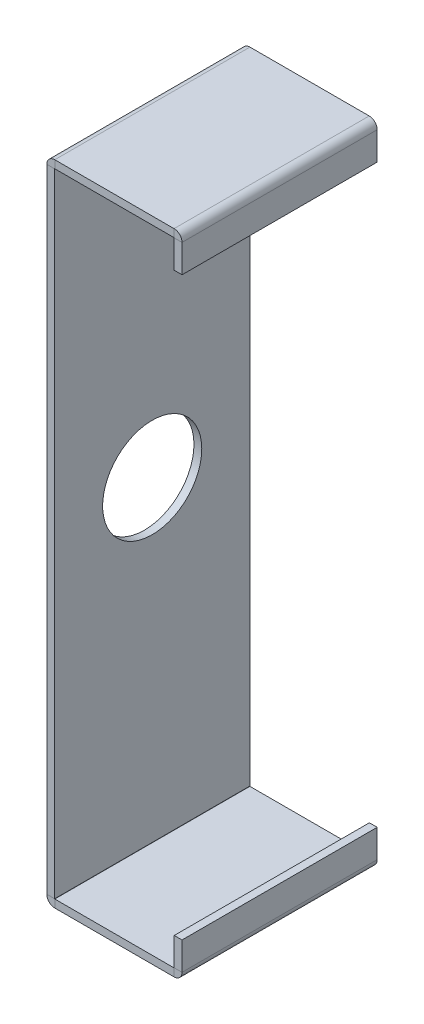
ISO-10303-21;
HEADER;
FILE_DESCRIPTION(('STEP AP214'),'2;1');
FILE_NAME('part.step','',(''),(''),'','','');
FILE_SCHEMA(('AUTOMOTIVE_DESIGN { 1 0 10303 214 1 1 1 1 }'));
ENDSEC;
DATA;
#1=APPLICATION_CONTEXT('core data for automotive mechanical design processes');
#2=APPLICATION_PROTOCOL_DEFINITION('international standard','automotive_design',2000,#1);
#3=PRODUCT_CONTEXT('',#1,'mechanical');
#4=PRODUCT('Part','Part','',(#3));
#5=PRODUCT_RELATED_PRODUCT_CATEGORY('part','',(#4));
#6=PRODUCT_DEFINITION_FORMATION('','',#4);
#7=PRODUCT_DEFINITION_CONTEXT('part definition',#1,'design');
#8=PRODUCT_DEFINITION('design','',#6,#7);
#9=PRODUCT_DEFINITION_SHAPE('','',#8);
#10=(LENGTH_UNIT() NAMED_UNIT(*) SI_UNIT(.MILLI.,.METRE.));
#11=(NAMED_UNIT(*) PLANE_ANGLE_UNIT() SI_UNIT($,.RADIAN.));
#12=(NAMED_UNIT(*) SI_UNIT($,.STERADIAN.) SOLID_ANGLE_UNIT());
#13=UNCERTAINTY_MEASURE_WITH_UNIT(LENGTH_MEASURE(1.E-05),#10,'distance_accuracy_value','');
#14=(GEOMETRIC_REPRESENTATION_CONTEXT(3) GLOBAL_UNCERTAINTY_ASSIGNED_CONTEXT((#13)) GLOBAL_UNIT_ASSIGNED_CONTEXT((#10,
#11,#12)) REPRESENTATION_CONTEXT('',''));
#15=CARTESIAN_POINT('',(0.,0.,0.));
#16=DIRECTION('',(0.,0.,1.));
#17=DIRECTION('',(1.,0.,0.));
#18=AXIS2_PLACEMENT_3D('',#15,#16,#17);
#19=CARTESIAN_POINT('',(5.24362769471076,-2.60202769471077,-1.5875));
#20=DIRECTION('',(-1.,0.,0.));
#21=DIRECTION('',(0.,0.,-1.));
#22=AXIS2_PLACEMENT_3D('',#19,#20,#21);
#23=PLANE('',#22);
#24=CARTESIAN_POINT('',(5.24362769471079,5.14497230528923,0.));
#25=DIRECTION('',(1.,0.,0.));
#26=DIRECTION('',(0.,0.,-1.));
#27=AXIS2_PLACEMENT_3D('',#24,#25,#26);
#28=CIRCLE('',#27,0.80644999999999);
#29=CARTESIAN_POINT('',(5.24362769471079,5.14497230528923,-0.80644999999999));
#30=VERTEX_POINT('',#29);
#31=EDGE_CURVE('E741',#30,#30,#28,.T.);
#32=ORIENTED_EDGE('',*,*,#31,.F.);
#33=EDGE_LOOP('',(#32));
#34=FACE_BOUND('',#33,.T.);
#35=DIRECTION('',(0.,1.,0.));
#36=VECTOR('',#35,1.);
#37=CARTESIAN_POINT('',(5.24362769471081,12.8919723052892,-1.5875));
#38=LINE('',#37,#36);
#39=CARTESIAN_POINT('',(5.24362769471077,0.0025400000000001,-1.5875));
#40=VERTEX_POINT('',#39);
#41=CARTESIAN_POINT('',(5.2436276947108,10.2874046105785,-1.5875));
#42=VERTEX_POINT('',#41);
#43=EDGE_CURVE('E67',#40,#42,#38,.T.);
#44=ORIENTED_EDGE('',*,*,#43,.T.);
#45=DIRECTION('',(0.,0.,1.));
#46=VECTOR('',#45,1.);
#47=CARTESIAN_POINT('',(5.2436276947108,10.2874046105785,-1.5875));
#48=LINE('',#47,#46);
#49=CARTESIAN_POINT('',(5.2436276947108,10.2874046105785,1.5875));
#50=VERTEX_POINT('',#49);
#51=EDGE_CURVE('E59',#42,#50,#48,.T.);
#52=ORIENTED_EDGE('',*,*,#51,.T.);
#53=DIRECTION('',(0.,-1.,0.));
#54=VECTOR('',#53,1.);
#55=CARTESIAN_POINT('',(5.24362769471081,12.8919723052892,1.5875));
#56=LINE('',#55,#54);
#57=CARTESIAN_POINT('',(5.24362769471077,0.0025400000000001,1.5875));
#58=VERTEX_POINT('',#57);
#59=EDGE_CURVE('E75',#50,#58,#56,.T.);
#60=ORIENTED_EDGE('',*,*,#59,.T.);
#61=DIRECTION('',(0.,0.,1.));
#62=VECTOR('',#61,1.);
#63=CARTESIAN_POINT('',(5.24362769471077,0.00253999999999879,-1.5875));
#64=LINE('',#63,#62);
#65=EDGE_CURVE('E366',#40,#58,#64,.T.);
#66=ORIENTED_EDGE('',*,*,#65,.F.);
#67=EDGE_LOOP('',(#44,#52,#60,#66));
#68=FACE_BOUND('',#67,.T.);
#69=ADVANCED_FACE('F50',(#34,#68),#23,.F.);
#70=CARTESIAN_POINT('',(5.11662769471081,12.8919723052892,1.5875));
#71=DIRECTION('',(0.,0.,1.));
#72=DIRECTION('',(0.,-1.,0.));
#73=AXIS2_PLACEMENT_3D('',#70,#71,#72);
#74=PLANE('',#73);
#75=DIRECTION('',(1.,0.,0.));
#76=VECTOR('',#75,1.);
#77=CARTESIAN_POINT('',(5.1166276947108,10.2874046105785,1.5875));
#78=LINE('',#77,#76);
#79=CARTESIAN_POINT('',(5.1166276947108,10.2874046105785,1.5875));
#80=VERTEX_POINT('',#79);
#81=EDGE_CURVE('E373',#80,#50,#78,.T.);
#82=ORIENTED_EDGE('',*,*,#81,.F.);
#83=DIRECTION('',(0.,-1.,0.));
#84=VECTOR('',#83,1.);
#85=CARTESIAN_POINT('',(5.11662769471081,12.8919723052892,1.5875));
#86=LINE('',#85,#84);
#87=CARTESIAN_POINT('',(5.11662769471077,0.00254000000000053,1.5875));
#88=VERTEX_POINT('',#87);
#89=EDGE_CURVE('E54',#80,#88,#86,.T.);
#90=ORIENTED_EDGE('',*,*,#89,.T.);
#91=DIRECTION('',(1.,0.,0.));
#92=VECTOR('',#91,1.);
#93=CARTESIAN_POINT('',(5.11662769471077,0.00254000000000053,1.5875));
#94=LINE('',#93,#92);
#95=EDGE_CURVE('E368',#88,#58,#94,.T.);
#96=ORIENTED_EDGE('',*,*,#95,.T.);
#97=ORIENTED_EDGE('',*,*,#59,.F.);
#98=EDGE_LOOP('',(#82,#90,#96,#97));
#99=FACE_BOUND('',#98,.T.);
#100=ADVANCED_FACE('F382',(#99),#74,.T.);
#101=CARTESIAN_POINT('',(5.11662769471081,12.8919723052892,-1.5875));
#102=DIRECTION('',(0.,0.,-1.));
#103=DIRECTION('',(0.,1.,0.));
#104=AXIS2_PLACEMENT_3D('',#101,#102,#103);
#105=PLANE('',#104);
#106=DIRECTION('',(-1.,0.,0.));
#107=VECTOR('',#106,1.);
#108=CARTESIAN_POINT('',(5.1166276947108,10.2874046105785,-1.5875));
#109=LINE('',#108,#107);
#110=CARTESIAN_POINT('',(5.1166276947108,10.2874046105785,-1.5875));
#111=VERTEX_POINT('',#110);
#112=EDGE_CURVE('E12',#42,#111,#109,.T.);
#113=ORIENTED_EDGE('',*,*,#112,.F.);
#114=ORIENTED_EDGE('',*,*,#43,.F.);
#115=DIRECTION('',(-1.,0.,0.));
#116=VECTOR('',#115,1.);
#117=CARTESIAN_POINT('',(5.11662769471077,0.00254000000000053,-1.5875));
#118=LINE('',#117,#116);
#119=CARTESIAN_POINT('',(5.11662769471077,0.00254000000000462,-1.5875));
#120=VERTEX_POINT('',#119);
#121=EDGE_CURVE('E363',#40,#120,#118,.T.);
#122=ORIENTED_EDGE('',*,*,#121,.T.);
#123=DIRECTION('',(0.,1.,0.));
#124=VECTOR('',#123,1.);
#125=CARTESIAN_POINT('',(5.11662769471081,12.8919723052892,-1.5875));
#126=LINE('',#125,#124);
#127=EDGE_CURVE('E377',#120,#111,#126,.T.);
#128=ORIENTED_EDGE('',*,*,#127,.T.);
#129=EDGE_LOOP('',(#113,#114,#122,#128));
#130=FACE_BOUND('',#129,.T.);
#131=ADVANCED_FACE('F52',(#130),#105,.T.);
#132=CARTESIAN_POINT('',(5.11662769471076,-2.60202769471077,-1.5875));
#133=DIRECTION('',(-1.,0.,0.));
#134=DIRECTION('',(0.,0.,-1.));
#135=AXIS2_PLACEMENT_3D('',#132,#133,#134);
#136=PLANE('',#135);
#137=CARTESIAN_POINT('',(5.11662769471079,5.14497230528923,0.));
#138=DIRECTION('',(-1.,0.,0.));
#139=DIRECTION('',(0.,-1.,0.));
#140=AXIS2_PLACEMENT_3D('',#137,#138,#139);
#141=CIRCLE('',#140,0.806449999999989);
#142=CARTESIAN_POINT('',(5.11662769471078,4.33852230528924,0.));
#143=VERTEX_POINT('',#142);
#144=EDGE_CURVE('E259',#143,#143,#141,.T.);
#145=ORIENTED_EDGE('',*,*,#144,.F.);
#146=EDGE_LOOP('',(#145));
#147=FACE_BOUND('',#146,.T.);
#148=DIRECTION('',(0.,0.,1.));
#149=VECTOR('',#148,1.);
#150=CARTESIAN_POINT('',(5.1166276947108,10.2874046105785,-1.5875));
#151=LINE('',#150,#149);
#152=EDGE_CURVE('E370',#111,#80,#151,.T.);
#153=ORIENTED_EDGE('',*,*,#152,.F.);
#154=ORIENTED_EDGE('',*,*,#127,.F.);
#155=DIRECTION('',(0.,0.,1.));
#156=VECTOR('',#155,1.);
#157=CARTESIAN_POINT('',(5.11662769471077,0.00253999999999966,-1.5875));
#158=LINE('',#157,#156);
#159=EDGE_CURVE('E360',#120,#88,#158,.T.);
#160=ORIENTED_EDGE('',*,*,#159,.T.);
#161=ORIENTED_EDGE('',*,*,#89,.F.);
#162=EDGE_LOOP('',(#153,#154,#160,#161));
#163=FACE_BOUND('',#162,.T.);
#164=ADVANCED_FACE('F464',(#147,#163),#136,.T.);
#165=CARTESIAN_POINT('',(7.31667230528923,0.458672305289232,1.5875));
#166=DIRECTION('',(0.,1.,0.));
#167=DIRECTION('',(0.,0.,-1.));
#168=AXIS2_PLACEMENT_3D('',#165,#166,#167);
#169=PLANE('',#168);
#170=DIRECTION('',(0.,0.,-1.));
#171=VECTOR('',#170,1.);
#172=CARTESIAN_POINT('',(7.18967230528923,0.458672305289231,1.5875));
#173=LINE('',#172,#171);
#174=CARTESIAN_POINT('',(7.18967230528923,0.458672305289231,1.5875));
#175=VERTEX_POINT('',#174);
#176=CARTESIAN_POINT('',(7.18967230528923,0.458672305289231,-1.5875));
#177=VERTEX_POINT('',#176);
#178=EDGE_CURVE('E332',#175,#177,#173,.T.);
#179=ORIENTED_EDGE('',*,*,#178,.F.);
#180=DIRECTION('',(-1.,0.,0.));
#181=VECTOR('',#180,1.);
#182=CARTESIAN_POINT('',(7.31667230528923,0.458672305289232,1.5875));
#183=LINE('',#182,#181);
#184=CARTESIAN_POINT('',(7.31667230528923,0.458672305289232,1.5875));
#185=VERTEX_POINT('',#184);
#186=EDGE_CURVE('E342',#185,#175,#183,.T.);
#187=ORIENTED_EDGE('',*,*,#186,.F.);
#188=DIRECTION('',(0.,0.,-1.));
#189=VECTOR('',#188,1.);
#190=CARTESIAN_POINT('',(7.31667230528923,0.458672305289232,1.5875));
#191=LINE('',#190,#189);
#192=CARTESIAN_POINT('',(7.31667230528923,0.458672305289232,-1.5875));
#193=VERTEX_POINT('',#192);
#194=EDGE_CURVE('E349',#185,#193,#191,.T.);
#195=ORIENTED_EDGE('',*,*,#194,.T.);
#196=DIRECTION('',(-1.,0.,0.));
#197=VECTOR('',#196,1.);
#198=CARTESIAN_POINT('',(7.31667230528923,0.458672305289232,-1.5875));
#199=LINE('',#198,#197);
#200=EDGE_CURVE('E347',#193,#177,#199,.T.);
#201=ORIENTED_EDGE('',*,*,#200,.T.);
#202=EDGE_LOOP('',(#179,#187,#195,#201));
#203=FACE_BOUND('',#202,.T.);
#204=ADVANCED_FACE('F467',(#203),#169,.T.);
#205=CARTESIAN_POINT('',(7.31667230528929,-15.0353276947108,1.5875));
#206=DIRECTION('',(0.,0.,1.));
#207=DIRECTION('',(0.,1.,0.));
#208=AXIS2_PLACEMENT_3D('',#205,#206,#207);
#209=PLANE('',#208);
#210=DIRECTION('',(-1.,0.,0.));
#211=VECTOR('',#210,1.);
#212=CARTESIAN_POINT('',(7.31667230528923,0.00254000000000053,1.5875));
#213=LINE('',#212,#211);
#214=CARTESIAN_POINT('',(7.31667230528923,0.00254000000000462,1.5875));
#215=VERTEX_POINT('',#214);
#216=CARTESIAN_POINT('',(7.18967230528923,0.00253999999999966,1.5875));
#217=VERTEX_POINT('',#216);
#218=EDGE_CURVE('E324',#215,#217,#213,.T.);
#219=ORIENTED_EDGE('',*,*,#218,.F.);
#220=DIRECTION('',(0.,1.,0.));
#221=VECTOR('',#220,1.);
#222=CARTESIAN_POINT('',(7.31667230528929,-15.0353276947108,1.5875));
#223=LINE('',#222,#221);
#224=EDGE_CURVE('E345',#215,#185,#223,.T.);
#225=ORIENTED_EDGE('',*,*,#224,.T.);
#226=ORIENTED_EDGE('',*,*,#186,.T.);
#227=DIRECTION('',(0.,1.,0.));
#228=VECTOR('',#227,1.);
#229=CARTESIAN_POINT('',(7.18967230528929,-15.0353276947108,1.5875));
#230=LINE('',#229,#228);
#231=EDGE_CURVE('E335',#217,#175,#230,.T.);
#232=ORIENTED_EDGE('',*,*,#231,.F.);
#233=EDGE_LOOP('',(#219,#225,#226,#232));
#234=FACE_BOUND('',#233,.T.);
#235=ADVANCED_FACE('F513',(#234),#209,.T.);
#236=CARTESIAN_POINT('',(7.18967230528923,0.458672305289231,-1.5875));
#237=DIRECTION('',(1.,0.,0.));
#238=DIRECTION('',(0.,0.,-1.));
#239=AXIS2_PLACEMENT_3D('',#236,#237,#238);
#240=PLANE('',#239);
#241=DIRECTION('',(0.,-1.,0.));
#242=VECTOR('',#241,1.);
#243=CARTESIAN_POINT('',(7.18967230528929,-15.0353276947108,-1.5875));
#244=LINE('',#243,#242);
#245=CARTESIAN_POINT('',(7.18967230528923,0.00253999999999966,-1.5875));
#246=VERTEX_POINT('',#245);
#247=EDGE_CURVE('E340',#177,#246,#244,.T.);
#248=ORIENTED_EDGE('',*,*,#247,.T.);
#249=DIRECTION('',(0.,0.,1.));
#250=VECTOR('',#249,1.);
#251=CARTESIAN_POINT('',(7.18967230528923,0.00253999999999879,-1.5875));
#252=LINE('',#251,#250);
#253=EDGE_CURVE('E337',#246,#217,#252,.T.);
#254=ORIENTED_EDGE('',*,*,#253,.T.);
#255=ORIENTED_EDGE('',*,*,#231,.T.);
#256=ORIENTED_EDGE('',*,*,#178,.T.);
#257=EDGE_LOOP('',(#248,#254,#255,#256));
#258=FACE_BOUND('',#257,.T.);
#259=ADVANCED_FACE('F509',(#258),#240,.F.);
#260=CARTESIAN_POINT('',(7.31667230528929,-15.0353276947108,-1.5875));
#261=DIRECTION('',(0.,0.,-1.));
#262=DIRECTION('',(0.,-1.,0.));
#263=AXIS2_PLACEMENT_3D('',#260,#261,#262);
#264=PLANE('',#263);
#265=DIRECTION('',(1.,0.,0.));
#266=VECTOR('',#265,1.);
#267=CARTESIAN_POINT('',(7.31667230528923,0.00254000000000053,-1.5875));
#268=LINE('',#267,#266);
#269=CARTESIAN_POINT('',(7.31667230528923,0.00254000000000053,-1.5875));
#270=VERTEX_POINT('',#269);
#271=EDGE_CURVE('E315',#246,#270,#268,.T.);
#272=ORIENTED_EDGE('',*,*,#271,.F.);
#273=ORIENTED_EDGE('',*,*,#247,.F.);
#274=ORIENTED_EDGE('',*,*,#200,.F.);
#275=DIRECTION('',(0.,-1.,0.));
#276=VECTOR('',#275,1.);
#277=CARTESIAN_POINT('',(7.31667230528929,-15.0353276947108,-1.5875));
#278=LINE('',#277,#276);
#279=EDGE_CURVE('E329',#193,#270,#278,.T.);
#280=ORIENTED_EDGE('',*,*,#279,.T.);
#281=EDGE_LOOP('',(#272,#273,#274,#280));
#282=FACE_BOUND('',#281,.T.);
#283=ADVANCED_FACE('F505',(#282),#264,.T.);
#284=CARTESIAN_POINT('',(7.31667230528923,0.458672305289232,-1.5875));
#285=DIRECTION('',(1.,0.,0.));
#286=DIRECTION('',(0.,0.,-1.));
#287=AXIS2_PLACEMENT_3D('',#284,#285,#286);
#288=PLANE('',#287);
#289=DIRECTION('',(0.,0.,1.));
#290=VECTOR('',#289,1.);
#291=CARTESIAN_POINT('',(7.31667230528923,0.00253999999999966,-1.5875));
#292=LINE('',#291,#290);
#293=EDGE_CURVE('E312',#270,#215,#292,.T.);
#294=ORIENTED_EDGE('',*,*,#293,.F.);
#295=ORIENTED_EDGE('',*,*,#279,.F.);
#296=ORIENTED_EDGE('',*,*,#194,.F.);
#297=ORIENTED_EDGE('',*,*,#224,.F.);
#298=EDGE_LOOP('',(#294,#295,#296,#297));
#299=FACE_BOUND('',#298,.T.);
#300=ADVANCED_FACE('F501',(#299),#288,.T.);
#301=CARTESIAN_POINT('',(7.18713230528923,0.00254000000000001,1.5875));
#302=DIRECTION('',(0.,0.,1.));
#303=DIRECTION('',(1.,0.,0.));
#304=AXIS2_PLACEMENT_3D('',#301,#302,#303);
#305=PLANE('',#304);
#306=CARTESIAN_POINT('',(7.18713230528923,0.00254000000000001,1.5875));
#307=DIRECTION('',(0.,0.,1.));
#308=DIRECTION('',(1.,0.,0.));
#309=AXIS2_PLACEMENT_3D('',#306,#307,#308);
#310=CIRCLE('',#309,0.00254000000000001);
#311=CARTESIAN_POINT('',(7.18713230528923,0.,1.5875));
#312=VERTEX_POINT('',#311);
#313=EDGE_CURVE('E327',#217,#312,#310,.F.);
#314=ORIENTED_EDGE('',*,*,#313,.T.);
#315=DIRECTION('',(0.,1.,0.));
#316=VECTOR('',#315,1.);
#317=CARTESIAN_POINT('',(7.18713230528923,-0.127,1.5875));
#318=LINE('',#317,#316);
#319=CARTESIAN_POINT('',(7.18713230528923,-0.127,1.5875));
#320=VERTEX_POINT('',#319);
#321=EDGE_CURVE('E284',#320,#312,#318,.T.);
#322=ORIENTED_EDGE('',*,*,#321,.F.);
#323=CARTESIAN_POINT('',(7.18713230528923,0.00254000000000001,1.5875));
#324=DIRECTION('',(0.,0.,-1.));
#325=DIRECTION('',(1.,0.,0.));
#326=AXIS2_PLACEMENT_3D('',#323,#324,#325);
#327=CIRCLE('',#326,0.12954);
#328=EDGE_CURVE('E309',#215,#320,#327,.T.);
#329=ORIENTED_EDGE('',*,*,#328,.F.);
#330=ORIENTED_EDGE('',*,*,#218,.T.);
#331=EDGE_LOOP('',(#314,#322,#329,#330));
#332=FACE_BOUND('',#331,.T.);
#333=ADVANCED_FACE('F497',(#332),#305,.T.);
#334=CARTESIAN_POINT('',(7.18713230528923,0.00254000000000001,-3.1792318303355));
#335=DIRECTION('',(0.,0.,1.));
#336=DIRECTION('',(1.,0.,0.));
#337=AXIS2_PLACEMENT_3D('',#334,#335,#336);
#338=CYLINDRICAL_SURFACE('',#337,0.00254000000000001);
#339=ORIENTED_EDGE('',*,*,#253,.F.);
#340=CARTESIAN_POINT('',(7.18713230528923,0.00254000000000001,-1.5875));
#341=DIRECTION('',(0.,0.,1.));
#342=DIRECTION('',(1.,0.,0.));
#343=AXIS2_PLACEMENT_3D('',#340,#341,#342);
#344=CIRCLE('',#343,0.00254000000000001);
#345=CARTESIAN_POINT('',(7.18713230528923,0.,-1.5875));
#346=VERTEX_POINT('',#345);
#347=EDGE_CURVE('E318',#346,#246,#344,.T.);
#348=ORIENTED_EDGE('',*,*,#347,.F.);
#349=DIRECTION('',(0.,0.,1.));
#350=VECTOR('',#349,1.);
#351=CARTESIAN_POINT('',(7.18713230528923,0.,-1.5875));
#352=LINE('',#351,#350);
#353=EDGE_CURVE('E321',#346,#312,#352,.T.);
#354=ORIENTED_EDGE('',*,*,#353,.T.);
#355=ORIENTED_EDGE('',*,*,#313,.F.);
#356=EDGE_LOOP('',(#339,#348,#354,#355));
#357=FACE_BOUND('',#356,.T.);
#358=ADVANCED_FACE('F493',(#357),#338,.F.);
#359=CARTESIAN_POINT('',(7.18713230528923,0.00254000000000001,-1.5875));
#360=DIRECTION('',(0.,0.,-1.));
#361=DIRECTION('',(-1.,0.,0.));
#362=AXIS2_PLACEMENT_3D('',#359,#360,#361);
#363=PLANE('',#362);
#364=DIRECTION('',(0.,-1.,0.));
#365=VECTOR('',#364,1.);
#366=CARTESIAN_POINT('',(7.18713230528923,-0.127,-1.5875));
#367=LINE('',#366,#365);
#368=CARTESIAN_POINT('',(7.18713230528923,-0.127,-1.5875));
#369=VERTEX_POINT('',#368);
#370=EDGE_CURVE('E300',#346,#369,#367,.T.);
#371=ORIENTED_EDGE('',*,*,#370,.F.);
#372=ORIENTED_EDGE('',*,*,#347,.T.);
#373=ORIENTED_EDGE('',*,*,#271,.T.);
#374=CARTESIAN_POINT('',(7.18713230528923,0.00254000000000001,-1.5875));
#375=DIRECTION('',(0.,0.,1.));
#376=DIRECTION('',(-1.,0.,0.));
#377=AXIS2_PLACEMENT_3D('',#374,#375,#376);
#378=CIRCLE('',#377,0.12954);
#379=EDGE_CURVE('E306',#369,#270,#378,.T.);
#380=ORIENTED_EDGE('',*,*,#379,.F.);
#381=EDGE_LOOP('',(#371,#372,#373,#380));
#382=FACE_BOUND('',#381,.T.);
#383=ADVANCED_FACE('F489',(#382),#363,.T.);
#384=CARTESIAN_POINT('',(7.18713230528923,0.00254000000000001,-3.1792318303355));
#385=DIRECTION('',(0.,0.,1.));
#386=DIRECTION('',(1.,0.,0.));
#387=AXIS2_PLACEMENT_3D('',#384,#385,#386);
#388=CYLINDRICAL_SURFACE('',#387,0.12954);
#389=ORIENTED_EDGE('',*,*,#293,.T.);
#390=ORIENTED_EDGE('',*,*,#328,.T.);
#391=DIRECTION('',(0.,0.,1.));
#392=VECTOR('',#391,1.);
#393=CARTESIAN_POINT('',(7.18713230528923,-0.127,-1.5875));
#394=LINE('',#393,#392);
#395=EDGE_CURVE('E303',#369,#320,#394,.T.);
#396=ORIENTED_EDGE('',*,*,#395,.F.);
#397=ORIENTED_EDGE('',*,*,#379,.T.);
#398=EDGE_LOOP('',(#389,#390,#396,#397));
#399=FACE_BOUND('',#398,.T.);
#400=ADVANCED_FACE('F485',(#399),#388,.T.);
#401=CARTESIAN_POINT('',(7.747,-0.127,-1.5875));
#402=DIRECTION('',(0.,-1.,0.));
#403=DIRECTION('',(0.,0.,-1.));
#404=AXIS2_PLACEMENT_3D('',#401,#402,#403);
#405=PLANE('',#404);
#406=DIRECTION('',(0.,0.,1.));
#407=VECTOR('',#406,1.);
#408=CARTESIAN_POINT('',(5.24616769471077,-0.127,-1.5875));
#409=LINE('',#408,#407);
#410=CARTESIAN_POINT('',(5.24616769471077,-0.127,-1.5875));
#411=VERTEX_POINT('',#410);
#412=CARTESIAN_POINT('',(5.24616769471077,-0.127,1.5875));
#413=VERTEX_POINT('',#412);
#414=EDGE_CURVE('E279',#411,#413,#409,.T.);
#415=ORIENTED_EDGE('',*,*,#414,.F.);
#416=DIRECTION('',(-1.,0.,0.));
#417=VECTOR('',#416,1.);
#418=CARTESIAN_POINT('',(-7.747,-0.127,-1.5875));
#419=LINE('',#418,#417);
#420=EDGE_CURVE('E298',#369,#411,#419,.T.);
#421=ORIENTED_EDGE('',*,*,#420,.F.);
#422=ORIENTED_EDGE('',*,*,#395,.T.);
#423=DIRECTION('',(1.,0.,0.));
#424=VECTOR('',#423,1.);
#425=CARTESIAN_POINT('',(-7.747,-0.127,1.5875));
#426=LINE('',#425,#424);
#427=EDGE_CURVE('E287',#413,#320,#426,.T.);
#428=ORIENTED_EDGE('',*,*,#427,.F.);
#429=EDGE_LOOP('',(#415,#421,#422,#428));
#430=FACE_BOUND('',#429,.T.);
#431=ADVANCED_FACE('F481',(#430),#405,.T.);
#432=CARTESIAN_POINT('',(-7.747,-0.127,-1.5875));
#433=DIRECTION('',(0.,0.,-1.));
#434=DIRECTION('',(-1.,0.,0.));
#435=AXIS2_PLACEMENT_3D('',#432,#433,#434);
#436=PLANE('',#435);
#437=DIRECTION('',(0.,-1.,0.));
#438=VECTOR('',#437,1.);
#439=CARTESIAN_POINT('',(5.24616769471077,-0.127,-1.5875));
#440=LINE('',#439,#438);
#441=CARTESIAN_POINT('',(5.24616769471077,0.,-1.5875));
#442=VERTEX_POINT('',#441);
#443=EDGE_CURVE('E352',#442,#411,#440,.T.);
#444=ORIENTED_EDGE('',*,*,#443,.F.);
#445=DIRECTION('',(-1.,0.,0.));
#446=VECTOR('',#445,1.);
#447=CARTESIAN_POINT('',(-7.747,0.,-1.5875));
#448=LINE('',#447,#446);
#449=EDGE_CURVE('E296',#346,#442,#448,.T.);
#450=ORIENTED_EDGE('',*,*,#449,.F.);
#451=ORIENTED_EDGE('',*,*,#370,.T.);
#452=ORIENTED_EDGE('',*,*,#420,.T.);
#453=EDGE_LOOP('',(#444,#450,#451,#452));
#454=FACE_BOUND('',#453,.T.);
#455=ADVANCED_FACE('F477',(#454),#436,.T.);
#456=CARTESIAN_POINT('',(7.747,0.,-1.5875));
#457=DIRECTION('',(0.,-1.,0.));
#458=DIRECTION('',(0.,0.,-1.));
#459=AXIS2_PLACEMENT_3D('',#456,#457,#458);
#460=PLANE('',#459);
#461=ORIENTED_EDGE('',*,*,#449,.T.);
#462=DIRECTION('',(0.,0.,1.));
#463=VECTOR('',#462,1.);
#464=CARTESIAN_POINT('',(5.24616769471077,0.,-1.5875));
#465=LINE('',#464,#463);
#466=CARTESIAN_POINT('',(5.24616769471077,0.,1.5875));
#467=VERTEX_POINT('',#466);
#468=EDGE_CURVE('E293',#442,#467,#465,.T.);
#469=ORIENTED_EDGE('',*,*,#468,.T.);
#470=DIRECTION('',(1.,0.,0.));
#471=VECTOR('',#470,1.);
#472=CARTESIAN_POINT('',(-7.747,0.,1.5875));
#473=LINE('',#472,#471);
#474=EDGE_CURVE('E290',#467,#312,#473,.T.);
#475=ORIENTED_EDGE('',*,*,#474,.T.);
#476=ORIENTED_EDGE('',*,*,#353,.F.);
#477=EDGE_LOOP('',(#461,#469,#475,#476));
#478=FACE_BOUND('',#477,.T.);
#479=ADVANCED_FACE('F473',(#478),#460,.F.);
#480=CARTESIAN_POINT('',(-7.747,-0.127,1.5875));
#481=DIRECTION('',(0.,0.,1.));
#482=DIRECTION('',(1.,0.,0.));
#483=AXIS2_PLACEMENT_3D('',#480,#481,#482);
#484=PLANE('',#483);
#485=DIRECTION('',(0.,1.,0.));
#486=VECTOR('',#485,1.);
#487=CARTESIAN_POINT('',(5.24616769471077,-0.127,1.5875));
#488=LINE('',#487,#486);
#489=EDGE_CURVE('E355',#413,#467,#488,.T.);
#490=ORIENTED_EDGE('',*,*,#489,.F.);
#491=ORIENTED_EDGE('',*,*,#427,.T.);
#492=ORIENTED_EDGE('',*,*,#321,.T.);
#493=ORIENTED_EDGE('',*,*,#474,.F.);
#494=EDGE_LOOP('',(#490,#491,#492,#493));
#495=FACE_BOUND('',#494,.T.);
#496=ADVANCED_FACE('F469',(#495),#484,.T.);
#497=CARTESIAN_POINT('',(5.24616769471077,0.00254000000000001,-1.5875));
#498=DIRECTION('',(0.,0.,-1.));
#499=DIRECTION('',(-1.,0.,0.));
#500=AXIS2_PLACEMENT_3D('',#497,#498,#499);
#501=PLANE('',#500);
#502=ORIENTED_EDGE('',*,*,#121,.F.);
#503=CARTESIAN_POINT('',(5.24616769471077,0.00254000000000001,-1.5875));
#504=DIRECTION('',(0.,0.,-1.));
#505=DIRECTION('',(-1.,0.,0.));
#506=AXIS2_PLACEMENT_3D('',#503,#504,#505);
#507=CIRCLE('',#506,0.00254000000000001);
#508=EDGE_CURVE('E267',#40,#442,#507,.F.);
#509=ORIENTED_EDGE('',*,*,#508,.T.);
#510=ORIENTED_EDGE('',*,*,#443,.T.);
#511=CARTESIAN_POINT('',(5.24616769471077,0.00254000000000001,-1.5875));
#512=DIRECTION('',(0.,0.,1.));
#513=DIRECTION('',(-1.,0.,0.));
#514=AXIS2_PLACEMENT_3D('',#511,#512,#513);
#515=CIRCLE('',#514,0.12954);
#516=EDGE_CURVE('E273',#120,#411,#515,.T.);
#517=ORIENTED_EDGE('',*,*,#516,.F.);
#518=EDGE_LOOP('',(#502,#509,#510,#517));
#519=FACE_BOUND('',#518,.T.);
#520=ADVANCED_FACE('F472',(#519),#501,.T.);
#521=CARTESIAN_POINT('',(5.24616769471077,0.00254000000000001,1.5875));
#522=DIRECTION('',(0.,0.,1.));
#523=DIRECTION('',(1.,0.,0.));
#524=AXIS2_PLACEMENT_3D('',#521,#522,#523);
#525=PLANE('',#524);
#526=CARTESIAN_POINT('',(5.24616769471077,0.00254000000000001,1.5875));
#527=DIRECTION('',(0.,0.,-1.));
#528=DIRECTION('',(-1.,0.,0.));
#529=AXIS2_PLACEMENT_3D('',#526,#527,#528);
#530=CIRCLE('',#529,0.00254000000000001);
#531=EDGE_CURVE('E277',#467,#58,#530,.T.);
#532=ORIENTED_EDGE('',*,*,#531,.T.);
#533=ORIENTED_EDGE('',*,*,#95,.F.);
#534=CARTESIAN_POINT('',(5.24616769471077,0.00254000000000001,1.5875));
#535=DIRECTION('',(0.,0.,-1.));
#536=DIRECTION('',(1.,0.,0.));
#537=AXIS2_PLACEMENT_3D('',#534,#535,#536);
#538=CIRCLE('',#537,0.12954);
#539=EDGE_CURVE('E276',#413,#88,#538,.T.);
#540=ORIENTED_EDGE('',*,*,#539,.F.);
#541=ORIENTED_EDGE('',*,*,#489,.T.);
#542=EDGE_LOOP('',(#532,#533,#540,#541));
#543=FACE_BOUND('',#542,.T.);
#544=ADVANCED_FACE('F385',(#543),#525,.T.);
#545=CARTESIAN_POINT('',(5.24616769471077,0.00254000000000001,3.1792318303355));
#546=DIRECTION('',(0.,0.,-1.));
#547=DIRECTION('',(-1.,0.,0.));
#548=AXIS2_PLACEMENT_3D('',#545,#546,#547);
#549=CYLINDRICAL_SURFACE('',#548,0.12954);
#550=ORIENTED_EDGE('',*,*,#414,.T.);
#551=ORIENTED_EDGE('',*,*,#539,.T.);
#552=ORIENTED_EDGE('',*,*,#159,.F.);
#553=ORIENTED_EDGE('',*,*,#516,.T.);
#554=EDGE_LOOP('',(#550,#551,#552,#553));
#555=FACE_BOUND('',#554,.T.);
#556=ADVANCED_FACE('F523',(#555),#549,.T.);
#557=CARTESIAN_POINT('',(5.24616769471077,0.00254000000000001,3.1792318303355));
#558=DIRECTION('',(0.,0.,-1.));
#559=DIRECTION('',(-1.,0.,0.));
#560=AXIS2_PLACEMENT_3D('',#557,#558,#559);
#561=CYLINDRICAL_SURFACE('',#560,0.00254000000000001);
#562=ORIENTED_EDGE('',*,*,#468,.F.);
#563=ORIENTED_EDGE('',*,*,#508,.F.);
#564=ORIENTED_EDGE('',*,*,#65,.T.);
#565=ORIENTED_EDGE('',*,*,#531,.F.);
#566=EDGE_LOOP('',(#562,#563,#564,#565));
#567=FACE_BOUND('',#566,.T.);
#568=ADVANCED_FACE('F390',(#567),#561,.F.);
#569=CARTESIAN_POINT('',(5.2461676947108,10.2874046105785,-1.5875));
#570=DIRECTION('',(0.,0.,-1.));
#571=DIRECTION('',(-1.,0.,0.));
#572=AXIS2_PLACEMENT_3D('',#569,#570,#571);
#573=PLANE('',#572);
#574=DIRECTION('',(0.,1.,0.));
#575=VECTOR('',#574,1.);
#576=CARTESIAN_POINT('',(5.24616769471081,10.4169446105785,-1.5875));
#577=LINE('',#576,#575);
#578=CARTESIAN_POINT('',(5.2461676947108,10.2899446105785,-1.5875));
#579=VERTEX_POINT('',#578);
#580=CARTESIAN_POINT('',(5.2461676947108,10.4169446105785,-1.5875));
#581=VERTEX_POINT('',#580);
#582=EDGE_CURVE('E403',#579,#581,#577,.T.);
#583=ORIENTED_EDGE('',*,*,#582,.F.);
#584=CARTESIAN_POINT('',(5.2461676947108,10.2874046105785,-1.5875));
#585=DIRECTION('',(0.,0.,-1.));
#586=DIRECTION('',(-1.,0.,0.));
#587=AXIS2_PLACEMENT_3D('',#584,#585,#586);
#588=CIRCLE('',#587,0.00254000000000001);
#589=EDGE_CURVE('E268',#579,#42,#588,.F.);
#590=ORIENTED_EDGE('',*,*,#589,.T.);
#591=ORIENTED_EDGE('',*,*,#112,.T.);
#592=CARTESIAN_POINT('',(5.2461676947108,10.2874046105785,-1.5875));
#593=DIRECTION('',(0.,0.,1.));
#594=DIRECTION('',(-1.,0.,0.));
#595=AXIS2_PLACEMENT_3D('',#592,#593,#594);
#596=CIRCLE('',#595,0.12954);
#597=EDGE_CURVE('E260',#581,#111,#596,.T.);
#598=ORIENTED_EDGE('',*,*,#597,.F.);
#599=EDGE_LOOP('',(#583,#590,#591,#598));
#600=FACE_BOUND('',#599,.T.);
#601=ADVANCED_FACE('F402',(#600),#573,.T.);
#602=CARTESIAN_POINT('',(5.2461676947108,10.2874046105785,1.5875));
#603=DIRECTION('',(0.,0.,1.));
#604=DIRECTION('',(1.,0.,0.));
#605=AXIS2_PLACEMENT_3D('',#602,#603,#604);
#606=PLANE('',#605);
#607=CARTESIAN_POINT('',(5.2461676947108,10.2874046105785,1.5875));
#608=DIRECTION('',(0.,0.,-1.));
#609=DIRECTION('',(-1.,0.,0.));
#610=AXIS2_PLACEMENT_3D('',#607,#608,#609);
#611=CIRCLE('',#610,0.00254000000000001);
#612=CARTESIAN_POINT('',(5.2461676947108,10.2899446105785,1.5875));
#613=VERTEX_POINT('',#612);
#614=EDGE_CURVE('E264',#50,#613,#611,.T.);
#615=ORIENTED_EDGE('',*,*,#614,.T.);
#616=DIRECTION('',(0.,-1.,0.));
#617=VECTOR('',#616,1.);
#618=CARTESIAN_POINT('',(5.24616769471081,10.4169446105785,1.5875));
#619=LINE('',#618,#617);
#620=CARTESIAN_POINT('',(5.24616769471081,10.4169446105785,1.5875));
#621=VERTEX_POINT('',#620);
#622=EDGE_CURVE('E202',#621,#613,#619,.T.);
#623=ORIENTED_EDGE('',*,*,#622,.F.);
#624=CARTESIAN_POINT('',(5.2461676947108,10.2874046105785,1.5875));
#625=DIRECTION('',(0.,0.,-1.));
#626=DIRECTION('',(1.,0.,0.));
#627=AXIS2_PLACEMENT_3D('',#624,#625,#626);
#628=CIRCLE('',#627,0.12954);
#629=EDGE_CURVE('E263',#80,#621,#628,.T.);
#630=ORIENTED_EDGE('',*,*,#629,.F.);
#631=ORIENTED_EDGE('',*,*,#81,.T.);
#632=EDGE_LOOP('',(#615,#623,#630,#631));
#633=FACE_BOUND('',#632,.T.);
#634=ADVANCED_FACE('F446',(#633),#606,.T.);
#635=CARTESIAN_POINT('',(5.2461676947108,10.2874046105785,3.1792318303355));
#636=DIRECTION('',(0.,0.,-1.));
#637=DIRECTION('',(-1.,0.,0.));
#638=AXIS2_PLACEMENT_3D('',#635,#636,#637);
#639=CYLINDRICAL_SURFACE('',#638,0.12954);
#640=ORIENTED_EDGE('',*,*,#152,.T.);
#641=ORIENTED_EDGE('',*,*,#629,.T.);
#642=DIRECTION('',(0.,0.,1.));
#643=VECTOR('',#642,1.);
#644=CARTESIAN_POINT('',(5.24616769471081,10.4169446105785,-1.5875));
#645=LINE('',#644,#643);
#646=EDGE_CURVE('E414',#581,#621,#645,.T.);
#647=ORIENTED_EDGE('',*,*,#646,.F.);
#648=ORIENTED_EDGE('',*,*,#597,.T.);
#649=EDGE_LOOP('',(#640,#641,#647,#648));
#650=FACE_BOUND('',#649,.T.);
#651=ADVANCED_FACE('F443',(#650),#639,.T.);
#652=CARTESIAN_POINT('',(5.2461676947108,10.2874046105785,3.1792318303355));
#653=DIRECTION('',(0.,0.,-1.));
#654=DIRECTION('',(-1.,0.,0.));
#655=AXIS2_PLACEMENT_3D('',#652,#653,#654);
#656=CYLINDRICAL_SURFACE('',#655,0.00254000000000001);
#657=ORIENTED_EDGE('',*,*,#51,.F.);
#658=ORIENTED_EDGE('',*,*,#589,.F.);
#659=DIRECTION('',(0.,0.,1.));
#660=VECTOR('',#659,1.);
#661=CARTESIAN_POINT('',(5.2461676947108,10.2899446105785,-1.5875));
#662=LINE('',#661,#660);
#663=EDGE_CURVE('E199',#579,#613,#662,.T.);
#664=ORIENTED_EDGE('',*,*,#663,.T.);
#665=ORIENTED_EDGE('',*,*,#614,.F.);
#666=EDGE_LOOP('',(#657,#658,#664,#665));
#667=FACE_BOUND('',#666,.T.);
#668=ADVANCED_FACE('F401',(#667),#656,.F.);
#669=CARTESIAN_POINT('',(7.31667230528926,9.83127230528921,1.5875));
#670=DIRECTION('',(0.,-1.,0.));
#671=DIRECTION('',(0.,0.,1.));
#672=AXIS2_PLACEMENT_3D('',#669,#670,#671);
#673=PLANE('',#672);
#674=DIRECTION('',(0.,0.,1.));
#675=VECTOR('',#674,1.);
#676=CARTESIAN_POINT('',(7.18967230528926,9.83127230528922,1.5875));
#677=LINE('',#676,#675);
#678=CARTESIAN_POINT('',(7.18967230528926,9.83127230528922,-1.5875));
#679=VERTEX_POINT('',#678);
#680=CARTESIAN_POINT('',(7.18967230528926,9.83127230528922,1.5875));
#681=VERTEX_POINT('',#680);
#682=EDGE_CURVE('E242',#679,#681,#677,.T.);
#683=ORIENTED_EDGE('',*,*,#682,.F.);
#684=DIRECTION('',(-1.,0.,0.));
#685=VECTOR('',#684,1.);
#686=CARTESIAN_POINT('',(7.31667230528926,9.83127230528921,-1.5875));
#687=LINE('',#686,#685);
#688=CARTESIAN_POINT('',(7.31667230528926,9.83127230528921,-1.5875));
#689=VERTEX_POINT('',#688);
#690=EDGE_CURVE('E247',#689,#679,#687,.T.);
#691=ORIENTED_EDGE('',*,*,#690,.F.);
#692=DIRECTION('',(0.,0.,1.));
#693=VECTOR('',#692,1.);
#694=CARTESIAN_POINT('',(7.31667230528926,9.83127230528921,1.5875));
#695=LINE('',#694,#693);
#696=CARTESIAN_POINT('',(7.31667230528926,9.83127230528921,1.5875));
#697=VERTEX_POINT('',#696);
#698=EDGE_CURVE('E255',#689,#697,#695,.T.);
#699=ORIENTED_EDGE('',*,*,#698,.T.);
#700=DIRECTION('',(-1.,0.,0.));
#701=VECTOR('',#700,1.);
#702=CARTESIAN_POINT('',(7.31667230528926,9.83127230528921,1.5875));
#703=LINE('',#702,#701);
#704=EDGE_CURVE('E253',#697,#681,#703,.T.);
#705=ORIENTED_EDGE('',*,*,#704,.T.);
#706=EDGE_LOOP('',(#683,#691,#699,#705));
#707=FACE_BOUND('',#706,.T.);
#708=ADVANCED_FACE('F582',(#707),#673,.T.);
#709=CARTESIAN_POINT('',(7.31667230528926,9.83127230528921,-1.5875));
#710=DIRECTION('',(0.,0.,-1.));
#711=DIRECTION('',(0.,-1.,0.));
#712=AXIS2_PLACEMENT_3D('',#709,#710,#711);
#713=PLANE('',#712);
#714=DIRECTION('',(0.,-1.,0.));
#715=VECTOR('',#714,1.);
#716=CARTESIAN_POINT('',(7.18967230528926,9.83127230528922,-1.5875));
#717=LINE('',#716,#715);
#718=CARTESIAN_POINT('',(7.18967230528927,10.2874046105784,-1.5875));
#719=VERTEX_POINT('',#718);
#720=EDGE_CURVE('E245',#719,#679,#717,.T.);
#721=ORIENTED_EDGE('',*,*,#720,.F.);
#722=DIRECTION('',(1.,0.,0.));
#723=VECTOR('',#722,1.);
#724=CARTESIAN_POINT('',(7.31667230528927,10.2874046105784,-1.5875));
#725=LINE('',#724,#723);
#726=CARTESIAN_POINT('',(7.31667230528927,10.2874046105785,-1.5875));
#727=VERTEX_POINT('',#726);
#728=EDGE_CURVE('E228',#719,#727,#725,.T.);
#729=ORIENTED_EDGE('',*,*,#728,.T.);
#730=DIRECTION('',(0.,-1.,0.));
#731=VECTOR('',#730,1.);
#732=CARTESIAN_POINT('',(7.31667230528926,9.83127230528921,-1.5875));
#733=LINE('',#732,#731);
#734=EDGE_CURVE('E250',#727,#689,#733,.T.);
#735=ORIENTED_EDGE('',*,*,#734,.T.);
#736=ORIENTED_EDGE('',*,*,#690,.T.);
#737=EDGE_LOOP('',(#721,#729,#735,#736));
#738=FACE_BOUND('',#737,.T.);
#739=ADVANCED_FACE('F593',(#738),#713,.T.);
#740=CARTESIAN_POINT('',(7.18967230528942,25.3252723052892,-1.5875));
#741=DIRECTION('',(1.,0.,0.));
#742=DIRECTION('',(0.,0.,-1.));
#743=AXIS2_PLACEMENT_3D('',#740,#741,#742);
#744=PLANE('',#743);
#745=DIRECTION('',(0.,0.,1.));
#746=VECTOR('',#745,1.);
#747=CARTESIAN_POINT('',(7.18967230528927,10.2874046105784,-1.5875));
#748=LINE('',#747,#746);
#749=CARTESIAN_POINT('',(7.18967230528927,10.2874046105784,1.5875));
#750=VERTEX_POINT('',#749);
#751=EDGE_CURVE('E214',#719,#750,#748,.T.);
#752=ORIENTED_EDGE('',*,*,#751,.F.);
#753=ORIENTED_EDGE('',*,*,#720,.T.);
#754=ORIENTED_EDGE('',*,*,#682,.T.);
#755=DIRECTION('',(0.,1.,0.));
#756=VECTOR('',#755,1.);
#757=CARTESIAN_POINT('',(7.18967230528926,9.83127230528922,1.5875));
#758=LINE('',#757,#756);
#759=EDGE_CURVE('E240',#681,#750,#758,.T.);
#760=ORIENTED_EDGE('',*,*,#759,.T.);
#761=EDGE_LOOP('',(#752,#753,#754,#760));
#762=FACE_BOUND('',#761,.T.);
#763=ADVANCED_FACE('F605',(#762),#744,.F.);
#764=CARTESIAN_POINT('',(7.31667230528926,9.83127230528921,1.5875));
#765=DIRECTION('',(0.,0.,1.));
#766=DIRECTION('',(0.,1.,0.));
#767=AXIS2_PLACEMENT_3D('',#764,#765,#766);
#768=PLANE('',#767);
#769=DIRECTION('',(0.,1.,0.));
#770=VECTOR('',#769,1.);
#771=CARTESIAN_POINT('',(7.31667230528926,9.83127230528921,1.5875));
#772=LINE('',#771,#770);
#773=CARTESIAN_POINT('',(7.31667230528927,10.2874046105784,1.5875));
#774=VERTEX_POINT('',#773);
#775=EDGE_CURVE('E237',#697,#774,#772,.T.);
#776=ORIENTED_EDGE('',*,*,#775,.T.);
#777=DIRECTION('',(-1.,0.,0.));
#778=VECTOR('',#777,1.);
#779=CARTESIAN_POINT('',(7.31667230528927,10.2874046105784,1.5875));
#780=LINE('',#779,#778);
#781=EDGE_CURVE('E231',#774,#750,#780,.T.);
#782=ORIENTED_EDGE('',*,*,#781,.T.);
#783=ORIENTED_EDGE('',*,*,#759,.F.);
#784=ORIENTED_EDGE('',*,*,#704,.F.);
#785=EDGE_LOOP('',(#776,#782,#783,#784));
#786=FACE_BOUND('',#785,.T.);
#787=ADVANCED_FACE('F616',(#786),#768,.T.);
#788=CARTESIAN_POINT('',(7.31667230528943,25.3252723052892,-1.5875));
#789=DIRECTION('',(1.,0.,0.));
#790=DIRECTION('',(0.,0.,-1.));
#791=AXIS2_PLACEMENT_3D('',#788,#789,#790);
#792=PLANE('',#791);
#793=ORIENTED_EDGE('',*,*,#734,.F.);
#794=DIRECTION('',(0.,0.,1.));
#795=VECTOR('',#794,1.);
#796=CARTESIAN_POINT('',(7.31667230528927,10.2874046105784,-1.5875));
#797=LINE('',#796,#795);
#798=EDGE_CURVE('E229',#727,#774,#797,.T.);
#799=ORIENTED_EDGE('',*,*,#798,.T.);
#800=ORIENTED_EDGE('',*,*,#775,.F.);
#801=ORIENTED_EDGE('',*,*,#698,.F.);
#802=EDGE_LOOP('',(#793,#799,#800,#801));
#803=FACE_BOUND('',#802,.T.);
#804=ADVANCED_FACE('F626',(#803),#792,.T.);
#805=CARTESIAN_POINT('',(7.18713230528927,10.2874046105784,-1.5875));
#806=DIRECTION('',(0.,0.,-1.));
#807=DIRECTION('',(0.,1.,0.));
#808=AXIS2_PLACEMENT_3D('',#805,#806,#807);
#809=PLANE('',#808);
#810=ORIENTED_EDGE('',*,*,#728,.F.);
#811=CARTESIAN_POINT('',(7.18713230528927,10.2874046105784,-1.5875));
#812=DIRECTION('',(0.,0.,-1.));
#813=DIRECTION('',(0.,1.,0.));
#814=AXIS2_PLACEMENT_3D('',#811,#812,#813);
#815=CIRCLE('',#814,0.00254000000000001);
#816=CARTESIAN_POINT('',(7.18713230528927,10.2899446105785,-1.5875));
#817=VERTEX_POINT('',#816);
#818=EDGE_CURVE('E215',#719,#817,#815,.F.);
#819=ORIENTED_EDGE('',*,*,#818,.T.);
#820=DIRECTION('',(0.,1.,0.));
#821=VECTOR('',#820,1.);
#822=CARTESIAN_POINT('',(7.18713230528927,10.4169446105784,-1.5875));
#823=LINE('',#822,#821);
#824=CARTESIAN_POINT('',(7.18713230528927,10.4169446105784,-1.5875));
#825=VERTEX_POINT('',#824);
#826=EDGE_CURVE('E206',#817,#825,#823,.T.);
#827=ORIENTED_EDGE('',*,*,#826,.T.);
#828=CARTESIAN_POINT('',(7.18713230528927,10.2874046105784,-1.5875));
#829=DIRECTION('',(0.,0.,1.));
#830=DIRECTION('',(0.,1.,0.));
#831=AXIS2_PLACEMENT_3D('',#828,#829,#830);
#832=CIRCLE('',#831,0.12954);
#833=EDGE_CURVE('E416',#727,#825,#832,.T.);
#834=ORIENTED_EDGE('',*,*,#833,.F.);
#835=EDGE_LOOP('',(#810,#819,#827,#834));
#836=FACE_BOUND('',#835,.T.);
#837=ADVANCED_FACE('F227',(#836),#809,.T.);
#838=CARTESIAN_POINT('',(7.18713230528927,10.2874046105784,3.1792318303355));
#839=DIRECTION('',(0.,0.,-1.));
#840=DIRECTION('',(0.,1.,0.));
#841=AXIS2_PLACEMENT_3D('',#838,#839,#840);
#842=CYLINDRICAL_SURFACE('',#841,0.00254000000000001);
#843=DIRECTION('',(0.,0.,1.));
#844=VECTOR('',#843,1.);
#845=CARTESIAN_POINT('',(7.18713230528927,10.2899446105785,-1.5875));
#846=LINE('',#845,#844);
#847=CARTESIAN_POINT('',(7.18713230528927,10.2899446105785,1.5875));
#848=VERTEX_POINT('',#847);
#849=EDGE_CURVE('E196',#817,#848,#846,.T.);
#850=ORIENTED_EDGE('',*,*,#849,.F.);
#851=ORIENTED_EDGE('',*,*,#818,.F.);
#852=ORIENTED_EDGE('',*,*,#751,.T.);
#853=CARTESIAN_POINT('',(7.18713230528927,10.2874046105784,1.5875));
#854=DIRECTION('',(0.,0.,-1.));
#855=DIRECTION('',(0.,1.,0.));
#856=AXIS2_PLACEMENT_3D('',#853,#854,#855);
#857=CIRCLE('',#856,0.00254000000000001);
#858=EDGE_CURVE('E223',#848,#750,#857,.T.);
#859=ORIENTED_EDGE('',*,*,#858,.F.);
#860=EDGE_LOOP('',(#850,#851,#852,#859));
#861=FACE_BOUND('',#860,.T.);
#862=ADVANCED_FACE('F220',(#861),#842,.F.);
#863=CARTESIAN_POINT('',(7.18713230528927,10.2874046105784,1.5875));
#864=DIRECTION('',(0.,0.,1.));
#865=DIRECTION('',(0.,-1.,0.));
#866=AXIS2_PLACEMENT_3D('',#863,#864,#865);
#867=PLANE('',#866);
#868=ORIENTED_EDGE('',*,*,#858,.T.);
#869=ORIENTED_EDGE('',*,*,#781,.F.);
#870=CARTESIAN_POINT('',(7.18713230528927,10.2874046105784,1.5875));
#871=DIRECTION('',(0.,0.,-1.));
#872=DIRECTION('',(0.,-1.,0.));
#873=AXIS2_PLACEMENT_3D('',#870,#871,#872);
#874=CIRCLE('',#873,0.12954);
#875=CARTESIAN_POINT('',(7.18713230528927,10.4169446105784,1.5875));
#876=VERTEX_POINT('',#875);
#877=EDGE_CURVE('E418',#876,#774,#874,.T.);
#878=ORIENTED_EDGE('',*,*,#877,.F.);
#879=DIRECTION('',(0.,-1.,0.));
#880=VECTOR('',#879,1.);
#881=CARTESIAN_POINT('',(7.18713230528927,10.4169446105784,1.5875));
#882=LINE('',#881,#880);
#883=EDGE_CURVE('E424',#876,#848,#882,.T.);
#884=ORIENTED_EDGE('',*,*,#883,.T.);
#885=EDGE_LOOP('',(#868,#869,#878,#884));
#886=FACE_BOUND('',#885,.T.);
#887=ADVANCED_FACE('F430',(#886),#867,.T.);
#888=CARTESIAN_POINT('',(7.18713230528927,10.2874046105784,3.1792318303355));
#889=DIRECTION('',(0.,0.,-1.));
#890=DIRECTION('',(0.,1.,0.));
#891=AXIS2_PLACEMENT_3D('',#888,#889,#890);
#892=CYLINDRICAL_SURFACE('',#891,0.12954);
#893=DIRECTION('',(0.,0.,1.));
#894=VECTOR('',#893,1.);
#895=CARTESIAN_POINT('',(7.18713230528927,10.4169446105784,-1.5875));
#896=LINE('',#895,#894);
#897=EDGE_CURVE('E421',#825,#876,#896,.T.);
#898=ORIENTED_EDGE('',*,*,#897,.T.);
#899=ORIENTED_EDGE('',*,*,#877,.T.);
#900=ORIENTED_EDGE('',*,*,#798,.F.);
#901=ORIENTED_EDGE('',*,*,#833,.T.);
#902=EDGE_LOOP('',(#898,#899,#900,#901));
#903=FACE_BOUND('',#902,.T.);
#904=ADVANCED_FACE('F437',(#903),#892,.T.);
#905=CARTESIAN_POINT('',(-7.74699999999996,10.4169446105786,-1.5875));
#906=DIRECTION('',(0.,1.,0.));
#907=DIRECTION('',(0.,0.,-1.));
#908=AXIS2_PLACEMENT_3D('',#905,#906,#907);
#909=PLANE('',#908);
#910=DIRECTION('',(1.,0.,0.));
#911=VECTOR('',#910,1.);
#912=CARTESIAN_POINT('',(7.74700000000004,10.4169446105784,-1.5875));
#913=LINE('',#912,#911);
#914=EDGE_CURVE('E209',#581,#825,#913,.T.);
#915=ORIENTED_EDGE('',*,*,#914,.F.);
#916=ORIENTED_EDGE('',*,*,#646,.T.);
#917=DIRECTION('',(-1.,0.,0.));
#918=VECTOR('',#917,1.);
#919=CARTESIAN_POINT('',(7.74700000000004,10.4169446105784,1.5875));
#920=LINE('',#919,#918);
#921=EDGE_CURVE('E411',#876,#621,#920,.T.);
#922=ORIENTED_EDGE('',*,*,#921,.F.);
#923=ORIENTED_EDGE('',*,*,#897,.F.);
#924=EDGE_LOOP('',(#915,#916,#922,#923));
#925=FACE_BOUND('',#924,.T.);
#926=ADVANCED_FACE('F440',(#925),#909,.T.);
#927=CARTESIAN_POINT('',(7.74700000000004,10.4169446105784,1.5875));
#928=DIRECTION('',(0.,0.,1.));
#929=DIRECTION('',(-1.,0.,0.));
#930=AXIS2_PLACEMENT_3D('',#927,#928,#929);
#931=PLANE('',#930);
#932=ORIENTED_EDGE('',*,*,#921,.T.);
#933=ORIENTED_EDGE('',*,*,#622,.T.);
#934=DIRECTION('',(-1.,0.,0.));
#935=VECTOR('',#934,1.);
#936=CARTESIAN_POINT('',(7.74700000000004,10.2899446105784,1.5875));
#937=LINE('',#936,#935);
#938=EDGE_CURVE('E224',#848,#613,#937,.T.);
#939=ORIENTED_EDGE('',*,*,#938,.F.);
#940=ORIENTED_EDGE('',*,*,#883,.F.);
#941=EDGE_LOOP('',(#932,#933,#939,#940));
#942=FACE_BOUND('',#941,.T.);
#943=ADVANCED_FACE('F434',(#942),#931,.T.);
#944=CARTESIAN_POINT('',(-7.74699999999996,10.2899446105786,-1.5875));
#945=DIRECTION('',(0.,1.,0.));
#946=DIRECTION('',(0.,0.,-1.));
#947=AXIS2_PLACEMENT_3D('',#944,#945,#946);
#948=PLANE('',#947);
#949=ORIENTED_EDGE('',*,*,#663,.F.);
#950=DIRECTION('',(1.,0.,0.));
#951=VECTOR('',#950,1.);
#952=CARTESIAN_POINT('',(7.74700000000004,10.2899446105784,-1.5875));
#953=LINE('',#952,#951);
#954=EDGE_CURVE('E192',#579,#817,#953,.T.);
#955=ORIENTED_EDGE('',*,*,#954,.T.);
#956=ORIENTED_EDGE('',*,*,#849,.T.);
#957=ORIENTED_EDGE('',*,*,#938,.T.);
#958=EDGE_LOOP('',(#949,#955,#956,#957));
#959=FACE_BOUND('',#958,.T.);
#960=ADVANCED_FACE('F194',(#959),#948,.F.);
#961=CARTESIAN_POINT('',(7.74700000000004,10.4169446105784,-1.5875));
#962=DIRECTION('',(0.,0.,-1.));
#963=DIRECTION('',(1.,0.,0.));
#964=AXIS2_PLACEMENT_3D('',#961,#962,#963);
#965=PLANE('',#964);
#966=ORIENTED_EDGE('',*,*,#954,.F.);
#967=ORIENTED_EDGE('',*,*,#582,.T.);
#968=ORIENTED_EDGE('',*,*,#914,.T.);
#969=ORIENTED_EDGE('',*,*,#826,.F.);
#970=EDGE_LOOP('',(#966,#967,#968,#969));
#971=FACE_BOUND('',#970,.T.);
#972=ADVANCED_FACE('F207',(#971),#965,.T.);
#973=CARTESIAN_POINT('',(5.24362769471078,5.14497230528923,0.));
#974=DIRECTION('',(1.,0.,0.));
#975=DIRECTION('',(0.,0.,-1.));
#976=AXIS2_PLACEMENT_3D('',#973,#974,#975);
#977=CYLINDRICAL_SURFACE('',#976,0.806449999999989);
#978=ORIENTED_EDGE('',*,*,#144,.T.);
#979=EDGE_LOOP('',(#978));
#980=FACE_BOUND('',#979,.T.);
#981=ORIENTED_EDGE('',*,*,#31,.T.);
#982=EDGE_LOOP('',(#981));
#983=FACE_BOUND('',#982,.T.);
#984=ADVANCED_FACE('F709',(#980,#983),#977,.F.);
#985=CLOSED_SHELL('',(#69,#100,#131,#164,#204,#235,#259,#283,#300,#333,#358,#383,#400,#431,#455,
#479,#496,#520,#544,#556,#568,#601,#634,#651,#668,#708,#739,#763,#787,#804,#837,#862,#887,#904,
#926,#943,#960,#972,#984));
#986=MANIFOLD_SOLID_BREP('B2',#985);
#987=ADVANCED_BREP_SHAPE_REPRESENTATION('',(#18,#986),#14);
#988=SHAPE_DEFINITION_REPRESENTATION(#9,#987);
ENDSEC;
END-ISO-10303-21;
